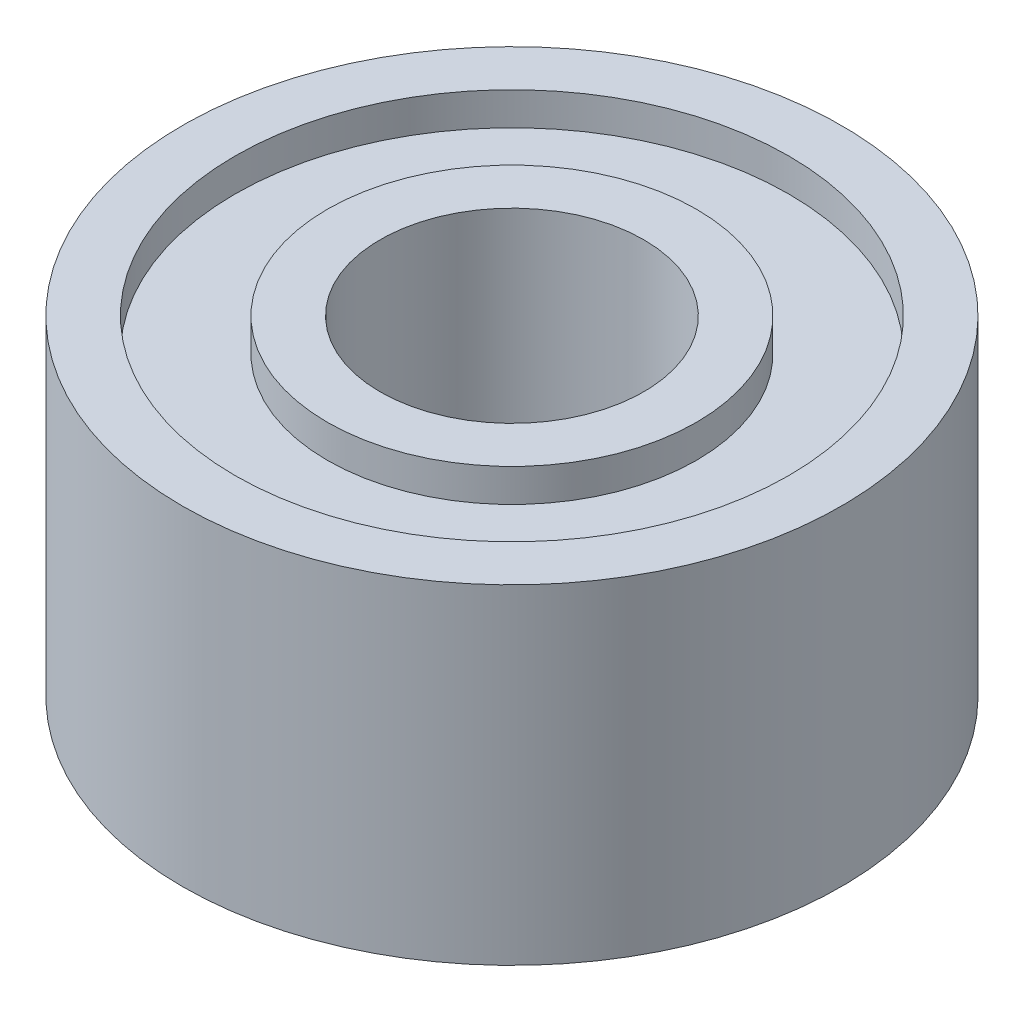
ISO-10303-21;
HEADER;
FILE_DESCRIPTION(('STEP AP214'),'2;1');
FILE_NAME('part.step','',(''),(''),'','','');
FILE_SCHEMA(('AUTOMOTIVE_DESIGN { 1 0 10303 214 1 1 1 1 }'));
ENDSEC;
DATA;
#1=APPLICATION_CONTEXT('core data for automotive mechanical design processes');
#2=APPLICATION_PROTOCOL_DEFINITION('international standard','automotive_design',2000,#1);
#3=PRODUCT_CONTEXT('',#1,'mechanical');
#4=PRODUCT('Part','Part','',(#3));
#5=PRODUCT_RELATED_PRODUCT_CATEGORY('part','',(#4));
#6=PRODUCT_DEFINITION_FORMATION('','',#4);
#7=PRODUCT_DEFINITION_CONTEXT('part definition',#1,'design');
#8=PRODUCT_DEFINITION('design','',#6,#7);
#9=PRODUCT_DEFINITION_SHAPE('','',#8);
#10=(LENGTH_UNIT() NAMED_UNIT(*) SI_UNIT(.MILLI.,.METRE.));
#11=(NAMED_UNIT(*) PLANE_ANGLE_UNIT() SI_UNIT($,.RADIAN.));
#12=(NAMED_UNIT(*) SI_UNIT($,.STERADIAN.) SOLID_ANGLE_UNIT());
#13=UNCERTAINTY_MEASURE_WITH_UNIT(LENGTH_MEASURE(1.E-05),#10,'distance_accuracy_value','');
#14=(GEOMETRIC_REPRESENTATION_CONTEXT(3) GLOBAL_UNCERTAINTY_ASSIGNED_CONTEXT((#13)) GLOBAL_UNIT_ASSIGNED_CONTEXT((#10,
#11,#12)) REPRESENTATION_CONTEXT('',''));
#15=CARTESIAN_POINT('',(0.,0.,0.));
#16=DIRECTION('',(0.,0.,1.));
#17=DIRECTION('',(1.,0.,0.));
#18=AXIS2_PLACEMENT_3D('',#15,#16,#17);
#19=CARTESIAN_POINT('',(0.,-1.25,0.));
#20=DIRECTION('',(0.,1.,0.));
#21=DIRECTION('',(0.,0.,1.));
#22=AXIS2_PLACEMENT_3D('',#19,#20,#21);
#23=PLANE('',#22);
#24=CARTESIAN_POINT('',(0.,-1.25,0.));
#25=DIRECTION('',(0.,1.,0.));
#26=DIRECTION('',(0.,0.,1.));
#27=AXIS2_PLACEMENT_3D('',#24,#25,#26);
#28=CIRCLE('',#27,1.);
#29=CARTESIAN_POINT('',(0.,-1.25,1.));
#30=VERTEX_POINT('',#29);
#31=EDGE_CURVE('E47',#30,#30,#28,.T.);
#32=ORIENTED_EDGE('',*,*,#31,.T.);
#33=EDGE_LOOP('',(#32));
#34=FACE_BOUND('',#33,.T.);
#35=CARTESIAN_POINT('',(0.,-1.25,0.));
#36=DIRECTION('',(0.,1.,0.));
#37=DIRECTION('',(0.,0.,1.));
#38=AXIS2_PLACEMENT_3D('',#35,#36,#37);
#39=CIRCLE('',#38,1.4);
#40=CARTESIAN_POINT('',(0.,-1.25,1.4));
#41=VERTEX_POINT('',#40);
#42=EDGE_CURVE('E71',#41,#41,#39,.T.);
#43=ORIENTED_EDGE('',*,*,#42,.F.);
#44=EDGE_LOOP('',(#43));
#45=FACE_BOUND('',#44,.T.);
#46=ADVANCED_FACE('F34',(#34,#45),#23,.F.);
#47=CARTESIAN_POINT('',(0.,1.25,0.));
#48=DIRECTION('',(0.,1.,0.));
#49=DIRECTION('',(0.,0.,1.));
#50=AXIS2_PLACEMENT_3D('',#47,#48,#49);
#51=PLANE('',#50);
#52=CARTESIAN_POINT('',(0.,1.25,0.));
#53=DIRECTION('',(0.,1.,0.));
#54=DIRECTION('',(0.,0.,1.));
#55=AXIS2_PLACEMENT_3D('',#52,#53,#54);
#56=CIRCLE('',#55,1.);
#57=CARTESIAN_POINT('',(0.,1.25,1.));
#58=VERTEX_POINT('',#57);
#59=EDGE_CURVE('E45',#58,#58,#56,.T.);
#60=ORIENTED_EDGE('',*,*,#59,.F.);
#61=EDGE_LOOP('',(#60));
#62=FACE_BOUND('',#61,.T.);
#63=CARTESIAN_POINT('',(0.,1.25,0.));
#64=DIRECTION('',(0.,1.,0.));
#65=DIRECTION('',(0.,0.,1.));
#66=AXIS2_PLACEMENT_3D('',#63,#64,#65);
#67=CIRCLE('',#66,1.4);
#68=CARTESIAN_POINT('',(0.,1.25,1.4));
#69=VERTEX_POINT('',#68);
#70=EDGE_CURVE('E59',#69,#69,#67,.T.);
#71=ORIENTED_EDGE('',*,*,#70,.T.);
#72=EDGE_LOOP('',(#71));
#73=FACE_BOUND('',#72,.T.);
#74=ADVANCED_FACE('F87',(#62,#73),#51,.T.);
#75=CARTESIAN_POINT('',(0.,1.25,0.));
#76=DIRECTION('',(0.,1.,0.));
#77=DIRECTION('',(0.,0.,1.));
#78=AXIS2_PLACEMENT_3D('',#75,#76,#77);
#79=CIRCLE('',#78,2.1);
#80=CARTESIAN_POINT('',(0.,1.25,2.1));
#81=VERTEX_POINT('',#80);
#82=EDGE_CURVE('E53',#81,#81,#79,.T.);
#83=ORIENTED_EDGE('',*,*,#82,.F.);
#84=EDGE_LOOP('',(#83));
#85=FACE_BOUND('',#84,.T.);
#86=CARTESIAN_POINT('',(0.,1.25,0.));
#87=DIRECTION('',(0.,1.,0.));
#88=DIRECTION('',(0.,0.,1.));
#89=AXIS2_PLACEMENT_3D('',#86,#87,#88);
#90=CIRCLE('',#89,2.5);
#91=CARTESIAN_POINT('',(0.,1.25,2.5));
#92=VERTEX_POINT('',#91);
#93=EDGE_CURVE('E10',#92,#92,#90,.T.);
#94=ORIENTED_EDGE('',*,*,#93,.T.);
#95=EDGE_LOOP('',(#94));
#96=FACE_BOUND('',#95,.T.);
#97=ADVANCED_FACE('F93',(#85,#96),#51,.T.);
#98=CARTESIAN_POINT('',(0.,-1.25,0.));
#99=DIRECTION('',(0.,1.,0.));
#100=DIRECTION('',(0.,0.,1.));
#101=AXIS2_PLACEMENT_3D('',#98,#99,#100);
#102=CIRCLE('',#101,2.1);
#103=CARTESIAN_POINT('',(0.,-1.25,2.1));
#104=VERTEX_POINT('',#103);
#105=EDGE_CURVE('E65',#104,#104,#102,.T.);
#106=ORIENTED_EDGE('',*,*,#105,.T.);
#107=EDGE_LOOP('',(#106));
#108=FACE_BOUND('',#107,.T.);
#109=CARTESIAN_POINT('',(0.,-1.25,0.));
#110=DIRECTION('',(0.,1.,0.));
#111=DIRECTION('',(0.,0.,1.));
#112=AXIS2_PLACEMENT_3D('',#109,#110,#111);
#113=CIRCLE('',#112,2.5);
#114=CARTESIAN_POINT('',(0.,-1.25,2.5));
#115=VERTEX_POINT('',#114);
#116=EDGE_CURVE('E38',#115,#115,#113,.T.);
#117=ORIENTED_EDGE('',*,*,#116,.F.);
#118=EDGE_LOOP('',(#117));
#119=FACE_BOUND('',#118,.T.);
#120=ADVANCED_FACE('F89',(#108,#119),#23,.F.);
#121=CARTESIAN_POINT('',(0.,1.25,0.));
#122=DIRECTION('',(0.,-1.,0.));
#123=DIRECTION('',(0.,0.,-1.));
#124=AXIS2_PLACEMENT_3D('',#121,#122,#123);
#125=CYLINDRICAL_SURFACE('',#124,2.5);
#126=ORIENTED_EDGE('',*,*,#93,.F.);
#127=EDGE_LOOP('',(#126));
#128=FACE_BOUND('',#127,.T.);
#129=ORIENTED_EDGE('',*,*,#116,.T.);
#130=EDGE_LOOP('',(#129));
#131=FACE_BOUND('',#130,.T.);
#132=ADVANCED_FACE('F36',(#128,#131),#125,.T.);
#133=CARTESIAN_POINT('',(0.,1.25,0.));
#134=DIRECTION('',(0.,-1.,0.));
#135=DIRECTION('',(0.,0.,-1.));
#136=AXIS2_PLACEMENT_3D('',#133,#134,#135);
#137=CYLINDRICAL_SURFACE('',#136,1.);
#138=ORIENTED_EDGE('',*,*,#59,.T.);
#139=EDGE_LOOP('',(#138));
#140=FACE_BOUND('',#139,.T.);
#141=ORIENTED_EDGE('',*,*,#31,.F.);
#142=EDGE_LOOP('',(#141));
#143=FACE_BOUND('',#142,.T.);
#144=ADVANCED_FACE('F102',(#140,#143),#137,.F.);
#145=CARTESIAN_POINT('',(0.,1.,0.));
#146=DIRECTION('',(0.,1.,0.));
#147=DIRECTION('',(0.,0.,1.));
#148=AXIS2_PLACEMENT_3D('',#145,#146,#147);
#149=CYLINDRICAL_SURFACE('',#148,2.1);
#150=CARTESIAN_POINT('',(0.,1.,0.));
#151=DIRECTION('',(0.,1.,0.));
#152=DIRECTION('',(0.,0.,1.));
#153=AXIS2_PLACEMENT_3D('',#150,#151,#152);
#154=CIRCLE('',#153,2.1);
#155=CARTESIAN_POINT('',(0.,1.,2.1));
#156=VERTEX_POINT('',#155);
#157=EDGE_CURVE('E50',#156,#156,#154,.T.);
#158=ORIENTED_EDGE('',*,*,#157,.F.);
#159=EDGE_LOOP('',(#158));
#160=FACE_BOUND('',#159,.T.);
#161=ORIENTED_EDGE('',*,*,#82,.T.);
#162=EDGE_LOOP('',(#161));
#163=FACE_BOUND('',#162,.T.);
#164=ADVANCED_FACE('F126',(#160,#163),#149,.F.);
#165=CARTESIAN_POINT('',(0.,1.,0.));
#166=DIRECTION('',(0.,1.,0.));
#167=DIRECTION('',(0.,0.,1.));
#168=AXIS2_PLACEMENT_3D('',#165,#166,#167);
#169=PLANE('',#168);
#170=CARTESIAN_POINT('',(0.,1.,0.));
#171=DIRECTION('',(0.,1.,0.));
#172=DIRECTION('',(0.,0.,1.));
#173=AXIS2_PLACEMENT_3D('',#170,#171,#172);
#174=CIRCLE('',#173,1.4);
#175=CARTESIAN_POINT('',(0.,1.,1.4));
#176=VERTEX_POINT('',#175);
#177=EDGE_CURVE('E56',#176,#176,#174,.T.);
#178=ORIENTED_EDGE('',*,*,#177,.F.);
#179=EDGE_LOOP('',(#178));
#180=FACE_BOUND('',#179,.T.);
#181=ORIENTED_EDGE('',*,*,#157,.T.);
#182=EDGE_LOOP('',(#181));
#183=FACE_BOUND('',#182,.T.);
#184=ADVANCED_FACE('F122',(#180,#183),#169,.T.);
#185=CARTESIAN_POINT('',(0.,1.,0.));
#186=DIRECTION('',(0.,1.,0.));
#187=DIRECTION('',(0.,0.,1.));
#188=AXIS2_PLACEMENT_3D('',#185,#186,#187);
#189=CYLINDRICAL_SURFACE('',#188,1.4);
#190=ORIENTED_EDGE('',*,*,#177,.T.);
#191=EDGE_LOOP('',(#190));
#192=FACE_BOUND('',#191,.T.);
#193=ORIENTED_EDGE('',*,*,#70,.F.);
#194=EDGE_LOOP('',(#193));
#195=FACE_BOUND('',#194,.T.);
#196=ADVANCED_FACE('F116',(#192,#195),#189,.T.);
#197=CARTESIAN_POINT('',(0.,-1.,0.));
#198=DIRECTION('',(0.,-1.,0.));
#199=DIRECTION('',(0.,0.,1.));
#200=AXIS2_PLACEMENT_3D('',#197,#198,#199);
#201=PLANE('',#200);
#202=CARTESIAN_POINT('',(0.,-1.,0.));
#203=DIRECTION('',(0.,1.,0.));
#204=DIRECTION('',(0.,0.,1.));
#205=AXIS2_PLACEMENT_3D('',#202,#203,#204);
#206=CIRCLE('',#205,2.1);
#207=CARTESIAN_POINT('',(0.,-1.,2.1));
#208=VERTEX_POINT('',#207);
#209=EDGE_CURVE('E62',#208,#208,#206,.T.);
#210=ORIENTED_EDGE('',*,*,#209,.F.);
#211=EDGE_LOOP('',(#210));
#212=FACE_BOUND('',#211,.T.);
#213=CARTESIAN_POINT('',(0.,-1.,0.));
#214=DIRECTION('',(0.,1.,0.));
#215=DIRECTION('',(0.,0.,1.));
#216=AXIS2_PLACEMENT_3D('',#213,#214,#215);
#217=CIRCLE('',#216,1.4);
#218=CARTESIAN_POINT('',(0.,-1.,1.4));
#219=VERTEX_POINT('',#218);
#220=EDGE_CURVE('E68',#219,#219,#217,.T.);
#221=ORIENTED_EDGE('',*,*,#220,.T.);
#222=EDGE_LOOP('',(#221));
#223=FACE_BOUND('',#222,.T.);
#224=ADVANCED_FACE('F77',(#212,#223),#201,.T.);
#225=CARTESIAN_POINT('',(0.,-1.,0.));
#226=DIRECTION('',(0.,-1.,0.));
#227=DIRECTION('',(0.,0.,-1.));
#228=AXIS2_PLACEMENT_3D('',#225,#226,#227);
#229=CYLINDRICAL_SURFACE('',#228,2.1);
#230=ORIENTED_EDGE('',*,*,#209,.T.);
#231=EDGE_LOOP('',(#230));
#232=FACE_BOUND('',#231,.T.);
#233=ORIENTED_EDGE('',*,*,#105,.F.);
#234=EDGE_LOOP('',(#233));
#235=FACE_BOUND('',#234,.T.);
#236=ADVANCED_FACE('F82',(#232,#235),#229,.F.);
#237=CARTESIAN_POINT('',(0.,-1.,0.));
#238=DIRECTION('',(0.,-1.,0.));
#239=DIRECTION('',(0.,0.,-1.));
#240=AXIS2_PLACEMENT_3D('',#237,#238,#239);
#241=CYLINDRICAL_SURFACE('',#240,1.4);
#242=ORIENTED_EDGE('',*,*,#220,.F.);
#243=EDGE_LOOP('',(#242));
#244=FACE_BOUND('',#243,.T.);
#245=ORIENTED_EDGE('',*,*,#42,.T.);
#246=EDGE_LOOP('',(#245));
#247=FACE_BOUND('',#246,.T.);
#248=ADVANCED_FACE('F79',(#244,#247),#241,.T.);
#249=CLOSED_SHELL('',(#46,#74,#97,#120,#132,#144,#164,#184,#196,#224,#236,#248));
#250=MANIFOLD_SOLID_BREP('B2',#249);
#251=ADVANCED_BREP_SHAPE_REPRESENTATION('',(#18,#250),#14);
#252=SHAPE_DEFINITION_REPRESENTATION(#9,#251);
ENDSEC;
END-ISO-10303-21;
